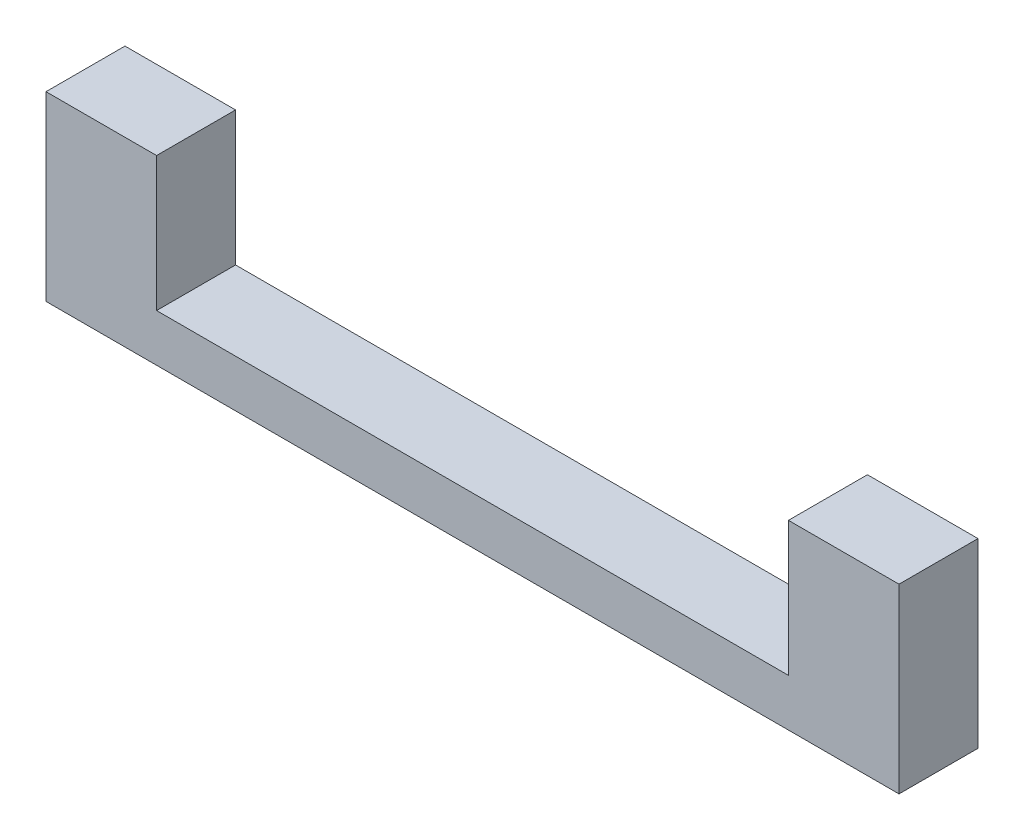
ISO-10303-21;
HEADER;
FILE_DESCRIPTION(('STEP AP214'),'2;1');
FILE_NAME('part.step','',(''),(''),'','','');
FILE_SCHEMA(('AUTOMOTIVE_DESIGN { 1 0 10303 214 1 1 1 1 }'));
ENDSEC;
DATA;
#1=APPLICATION_CONTEXT('core data for automotive mechanical design processes');
#2=APPLICATION_PROTOCOL_DEFINITION('international standard','automotive_design',2000,#1);
#3=PRODUCT_CONTEXT('',#1,'mechanical');
#4=PRODUCT('Part','Part','',(#3));
#5=PRODUCT_RELATED_PRODUCT_CATEGORY('part','',(#4));
#6=PRODUCT_DEFINITION_FORMATION('','',#4);
#7=PRODUCT_DEFINITION_CONTEXT('part definition',#1,'design');
#8=PRODUCT_DEFINITION('design','',#6,#7);
#9=PRODUCT_DEFINITION_SHAPE('','',#8);
#10=(LENGTH_UNIT() NAMED_UNIT(*) SI_UNIT(.MILLI.,.METRE.));
#11=(NAMED_UNIT(*) PLANE_ANGLE_UNIT() SI_UNIT($,.RADIAN.));
#12=(NAMED_UNIT(*) SI_UNIT($,.STERADIAN.) SOLID_ANGLE_UNIT());
#13=UNCERTAINTY_MEASURE_WITH_UNIT(LENGTH_MEASURE(1.E-05),#10,'distance_accuracy_value','');
#14=(GEOMETRIC_REPRESENTATION_CONTEXT(3) GLOBAL_UNCERTAINTY_ASSIGNED_CONTEXT((#13)) GLOBAL_UNIT_ASSIGNED_CONTEXT((#10,
#11,#12)) REPRESENTATION_CONTEXT('',''));
#15=CARTESIAN_POINT('',(0.,0.,0.));
#16=DIRECTION('',(0.,0.,1.));
#17=DIRECTION('',(1.,0.,0.));
#18=AXIS2_PLACEMENT_3D('',#15,#16,#17);
#19=CARTESIAN_POINT('',(5.,4.25,4.25));
#20=DIRECTION('',(0.,-1.,0.));
#21=DIRECTION('',(0.,0.,-1.));
#22=AXIS2_PLACEMENT_3D('',#19,#20,#21);
#23=PLANE('',#22);
#24=DIRECTION('',(0.,0.,1.));
#25=VECTOR('',#24,1.);
#26=CARTESIAN_POINT('',(5.,4.25,4.25));
#27=LINE('',#26,#25);
#28=CARTESIAN_POINT('',(5.,4.25,-0.750000000000002));
#29=VERTEX_POINT('',#28);
#30=CARTESIAN_POINT('',(5.,4.25,4.25));
#31=VERTEX_POINT('',#30);
#32=EDGE_CURVE('E112',#29,#31,#27,.T.);
#33=ORIENTED_EDGE('',*,*,#32,.F.);
#34=DIRECTION('',(1.,0.,0.));
#35=VECTOR('',#34,1.);
#36=CARTESIAN_POINT('',(-2.,4.25,-0.750000000000002));
#37=LINE('',#36,#35);
#38=CARTESIAN_POINT('',(-2.,4.25,-0.750000000000002));
#39=VERTEX_POINT('',#38);
#40=EDGE_CURVE('E52',#39,#29,#37,.T.);
#41=ORIENTED_EDGE('',*,*,#40,.F.);
#42=DIRECTION('',(0.,0.,-1.));
#43=VECTOR('',#42,1.);
#44=CARTESIAN_POINT('',(-2.,4.25,-4.25));
#45=LINE('',#44,#43);
#46=CARTESIAN_POINT('',(-2.,4.25,4.25));
#47=VERTEX_POINT('',#46);
#48=EDGE_CURVE('E45',#47,#39,#45,.T.);
#49=ORIENTED_EDGE('',*,*,#48,.F.);
#50=DIRECTION('',(-1.,0.,0.));
#51=VECTOR('',#50,1.);
#52=CARTESIAN_POINT('',(5.,4.25,4.25));
#53=LINE('',#52,#51);
#54=EDGE_CURVE('E11',#31,#47,#53,.T.);
#55=ORIENTED_EDGE('',*,*,#54,.F.);
#56=EDGE_LOOP('',(#33,#41,#49,#55));
#57=FACE_BOUND('',#56,.T.);
#58=ADVANCED_FACE('F38',(#57),#23,.F.);
#59=CARTESIAN_POINT('',(0.,-4.25,0.));
#60=DIRECTION('',(0.,-1.,0.));
#61=DIRECTION('',(0.,0.,-1.));
#62=AXIS2_PLACEMENT_3D('',#59,#60,#61);
#63=PLANE('',#62);
#64=DIRECTION('',(0.,0.,1.));
#65=VECTOR('',#64,1.);
#66=CARTESIAN_POINT('',(45.,-4.25,-4.25));
#67=LINE('',#66,#65);
#68=CARTESIAN_POINT('',(45.,-4.25,-0.750000000000002));
#69=VERTEX_POINT('',#68);
#70=CARTESIAN_POINT('',(45.,-4.25,4.25));
#71=VERTEX_POINT('',#70);
#72=EDGE_CURVE('E138',#69,#71,#67,.T.);
#73=ORIENTED_EDGE('',*,*,#72,.F.);
#74=DIRECTION('',(-1.,0.,0.));
#75=VECTOR('',#74,1.);
#76=CARTESIAN_POINT('',(0.,-4.25,-0.750000000000002));
#77=LINE('',#76,#75);
#78=CARTESIAN_POINT('',(5.,-4.25,-0.750000000000002));
#79=VERTEX_POINT('',#78);
#80=EDGE_CURVE('E155',#69,#79,#77,.T.);
#81=ORIENTED_EDGE('',*,*,#80,.T.);
#82=DIRECTION('',(0.,0.,-1.));
#83=VECTOR('',#82,1.);
#84=CARTESIAN_POINT('',(5.,-4.25,4.25));
#85=LINE('',#84,#83);
#86=CARTESIAN_POINT('',(5.,-4.25,4.25));
#87=VERTEX_POINT('',#86);
#88=EDGE_CURVE('E145',#87,#79,#85,.T.);
#89=ORIENTED_EDGE('',*,*,#88,.F.);
#90=DIRECTION('',(-1.,0.,0.));
#91=VECTOR('',#90,1.);
#92=CARTESIAN_POINT('',(-2.,-4.25,4.25));
#93=LINE('',#92,#91);
#94=EDGE_CURVE('E122',#71,#87,#93,.T.);
#95=ORIENTED_EDGE('',*,*,#94,.F.);
#96=EDGE_LOOP('',(#73,#81,#89,#95));
#97=FACE_BOUND('',#96,.T.);
#98=ADVANCED_FACE('F188',(#97),#63,.F.);
#99=CARTESIAN_POINT('',(5.,-4.25,4.25));
#100=DIRECTION('',(0.,0.,-1.));
#101=DIRECTION('',(-1.,0.,0.));
#102=AXIS2_PLACEMENT_3D('',#99,#100,#101);
#103=PLANE('',#102);
#104=DIRECTION('',(0.,1.,0.));
#105=VECTOR('',#104,1.);
#106=CARTESIAN_POINT('',(52.,-7.25,4.25));
#107=LINE('',#106,#105);
#108=CARTESIAN_POINT('',(52.,-7.25,4.25));
#109=VERTEX_POINT('',#108);
#110=CARTESIAN_POINT('',(52.,4.25,4.25));
#111=VERTEX_POINT('',#110);
#112=EDGE_CURVE('E117',#109,#111,#107,.T.);
#113=ORIENTED_EDGE('',*,*,#112,.T.);
#114=DIRECTION('',(-1.,0.,0.));
#115=VECTOR('',#114,1.);
#116=CARTESIAN_POINT('',(52.,4.25,4.25));
#117=LINE('',#116,#115);
#118=CARTESIAN_POINT('',(45.,4.25,4.25));
#119=VERTEX_POINT('',#118);
#120=EDGE_CURVE('E131',#111,#119,#117,.T.);
#121=ORIENTED_EDGE('',*,*,#120,.T.);
#122=DIRECTION('',(0.,-1.,0.));
#123=VECTOR('',#122,1.);
#124=CARTESIAN_POINT('',(45.,15.2613577727726,4.25));
#125=LINE('',#124,#123);
#126=EDGE_CURVE('E135',#119,#71,#125,.T.);
#127=ORIENTED_EDGE('',*,*,#126,.T.);
#128=ORIENTED_EDGE('',*,*,#94,.T.);
#129=DIRECTION('',(0.,-1.,0.));
#130=VECTOR('',#129,1.);
#131=CARTESIAN_POINT('',(5.,4.25,4.25));
#132=LINE('',#131,#130);
#133=EDGE_CURVE('E148',#31,#87,#132,.T.);
#134=ORIENTED_EDGE('',*,*,#133,.F.);
#135=ORIENTED_EDGE('',*,*,#54,.T.);
#136=DIRECTION('',(0.,1.,0.));
#137=VECTOR('',#136,1.);
#138=CARTESIAN_POINT('',(-2.,-4.25,4.25));
#139=LINE('',#138,#137);
#140=CARTESIAN_POINT('',(-2.,-7.25,4.25));
#141=VERTEX_POINT('',#140);
#142=EDGE_CURVE('E116',#141,#47,#139,.T.);
#143=ORIENTED_EDGE('',*,*,#142,.F.);
#144=DIRECTION('',(-1.,0.,0.));
#145=VECTOR('',#144,1.);
#146=CARTESIAN_POINT('',(-2.,-7.25,4.25));
#147=LINE('',#146,#145);
#148=EDGE_CURVE('E121',#109,#141,#147,.T.);
#149=ORIENTED_EDGE('',*,*,#148,.F.);
#150=EDGE_LOOP('',(#113,#121,#127,#128,#134,#135,#143,#149));
#151=FACE_BOUND('',#150,.T.);
#152=ADVANCED_FACE('F171',(#151),#103,.F.);
#153=CARTESIAN_POINT('',(-2.,0.,0.));
#154=DIRECTION('',(1.,0.,0.));
#155=DIRECTION('',(0.,0.,-1.));
#156=AXIS2_PLACEMENT_3D('',#153,#154,#155);
#157=PLANE('',#156);
#158=ORIENTED_EDGE('',*,*,#48,.T.);
#159=DIRECTION('',(0.,1.,0.));
#160=VECTOR('',#159,1.);
#161=CARTESIAN_POINT('',(-2.,-10.75,-0.750000000000002));
#162=LINE('',#161,#160);
#163=CARTESIAN_POINT('',(-2.,-7.25,-0.750000000000002));
#164=VERTEX_POINT('',#163);
#165=EDGE_CURVE('E99',#164,#39,#162,.T.);
#166=ORIENTED_EDGE('',*,*,#165,.F.);
#167=DIRECTION('',(0.,0.,-1.));
#168=VECTOR('',#167,1.);
#169=CARTESIAN_POINT('',(-2.,-7.25,4.25));
#170=LINE('',#169,#168);
#171=EDGE_CURVE('E124',#141,#164,#170,.T.);
#172=ORIENTED_EDGE('',*,*,#171,.F.);
#173=ORIENTED_EDGE('',*,*,#142,.T.);
#174=EDGE_LOOP('',(#158,#166,#172,#173));
#175=FACE_BOUND('',#174,.T.);
#176=ADVANCED_FACE('F115',(#175),#157,.F.);
#177=CARTESIAN_POINT('',(52.,-7.25,4.25));
#178=DIRECTION('',(-1.,0.,0.));
#179=DIRECTION('',(0.,0.,1.));
#180=AXIS2_PLACEMENT_3D('',#177,#178,#179);
#181=PLANE('',#180);
#182=DIRECTION('',(0.,1.,0.));
#183=VECTOR('',#182,1.);
#184=CARTESIAN_POINT('',(52.,-10.75,-0.750000000000002));
#185=LINE('',#184,#183);
#186=CARTESIAN_POINT('',(52.,-7.25,-0.750000000000002));
#187=VERTEX_POINT('',#186);
#188=CARTESIAN_POINT('',(52.,4.25,-0.750000000000002));
#189=VERTEX_POINT('',#188);
#190=EDGE_CURVE('E107',#187,#189,#185,.T.);
#191=ORIENTED_EDGE('',*,*,#190,.T.);
#192=DIRECTION('',(0.,0.,1.));
#193=VECTOR('',#192,1.);
#194=CARTESIAN_POINT('',(52.,4.25,-4.25));
#195=LINE('',#194,#193);
#196=EDGE_CURVE('E125',#189,#111,#195,.T.);
#197=ORIENTED_EDGE('',*,*,#196,.T.);
#198=ORIENTED_EDGE('',*,*,#112,.F.);
#199=DIRECTION('',(0.,0.,1.));
#200=VECTOR('',#199,1.);
#201=CARTESIAN_POINT('',(52.,-7.25,4.25));
#202=LINE('',#201,#200);
#203=EDGE_CURVE('E128',#187,#109,#202,.T.);
#204=ORIENTED_EDGE('',*,*,#203,.F.);
#205=EDGE_LOOP('',(#191,#197,#198,#204));
#206=FACE_BOUND('',#205,.T.);
#207=ADVANCED_FACE('F163',(#206),#181,.F.);
#208=CARTESIAN_POINT('',(0.,-7.25,0.));
#209=DIRECTION('',(0.,-1.,0.));
#210=DIRECTION('',(0.,0.,-1.));
#211=AXIS2_PLACEMENT_3D('',#208,#209,#210);
#212=PLANE('',#211);
#213=DIRECTION('',(-1.,0.,0.));
#214=VECTOR('',#213,1.);
#215=CARTESIAN_POINT('',(0.,-7.25,-0.750000000000002));
#216=LINE('',#215,#214);
#217=EDGE_CURVE('E102',#187,#164,#216,.T.);
#218=ORIENTED_EDGE('',*,*,#217,.F.);
#219=ORIENTED_EDGE('',*,*,#203,.T.);
#220=ORIENTED_EDGE('',*,*,#148,.T.);
#221=ORIENTED_EDGE('',*,*,#171,.T.);
#222=EDGE_LOOP('',(#218,#219,#220,#221));
#223=FACE_BOUND('',#222,.T.);
#224=ADVANCED_FACE('F175',(#223),#212,.T.);
#225=CARTESIAN_POINT('',(45.,15.2613577727726,-4.25));
#226=DIRECTION('',(1.,0.,0.));
#227=DIRECTION('',(0.,0.,-1.));
#228=AXIS2_PLACEMENT_3D('',#225,#226,#227);
#229=PLANE('',#228);
#230=DIRECTION('',(0.,0.,-1.));
#231=VECTOR('',#230,1.);
#232=CARTESIAN_POINT('',(45.,4.25,-4.25));
#233=LINE('',#232,#231);
#234=CARTESIAN_POINT('',(45.,4.25,-0.750000000000002));
#235=VERTEX_POINT('',#234);
#236=EDGE_CURVE('E134',#119,#235,#233,.T.);
#237=ORIENTED_EDGE('',*,*,#236,.T.);
#238=DIRECTION('',(0.,-1.,0.));
#239=VECTOR('',#238,1.);
#240=CARTESIAN_POINT('',(45.,15.2613577727726,-0.750000000000002));
#241=LINE('',#240,#239);
#242=EDGE_CURVE('E152',#235,#69,#241,.T.);
#243=ORIENTED_EDGE('',*,*,#242,.T.);
#244=ORIENTED_EDGE('',*,*,#72,.T.);
#245=ORIENTED_EDGE('',*,*,#126,.F.);
#246=EDGE_LOOP('',(#237,#243,#244,#245));
#247=FACE_BOUND('',#246,.T.);
#248=ADVANCED_FACE('F177',(#247),#229,.F.);
#249=CARTESIAN_POINT('',(5.,4.25,4.25));
#250=DIRECTION('',(0.,-1.,0.));
#251=DIRECTION('',(0.,0.,-1.));
#252=AXIS2_PLACEMENT_3D('',#249,#250,#251);
#253=PLANE('',#252);
#254=ORIENTED_EDGE('',*,*,#196,.F.);
#255=EDGE_CURVE('E113',#235,#189,#37,.T.);
#256=ORIENTED_EDGE('',*,*,#255,.F.);
#257=ORIENTED_EDGE('',*,*,#236,.F.);
#258=ORIENTED_EDGE('',*,*,#120,.F.);
#259=EDGE_LOOP('',(#254,#256,#257,#258));
#260=FACE_BOUND('',#259,.T.);
#261=ADVANCED_FACE('F169',(#260),#253,.F.);
#262=CARTESIAN_POINT('',(5.,0.,0.));
#263=DIRECTION('',(1.,0.,0.));
#264=DIRECTION('',(0.,0.,-1.));
#265=AXIS2_PLACEMENT_3D('',#262,#263,#264);
#266=PLANE('',#265);
#267=DIRECTION('',(0.,-1.,0.));
#268=VECTOR('',#267,1.);
#269=CARTESIAN_POINT('',(5.,0.,-0.750000000000002));
#270=LINE('',#269,#268);
#271=EDGE_CURVE('E158',#29,#79,#270,.T.);
#272=ORIENTED_EDGE('',*,*,#271,.F.);
#273=ORIENTED_EDGE('',*,*,#32,.T.);
#274=ORIENTED_EDGE('',*,*,#133,.T.);
#275=ORIENTED_EDGE('',*,*,#88,.T.);
#276=EDGE_LOOP('',(#272,#273,#274,#275));
#277=FACE_BOUND('',#276,.T.);
#278=ADVANCED_FACE('F221',(#277),#266,.T.);
#279=CARTESIAN_POINT('',(-2.,-10.75,-0.750000000000002));
#280=DIRECTION('',(0.,0.,1.));
#281=DIRECTION('',(1.,0.,0.));
#282=AXIS2_PLACEMENT_3D('',#279,#280,#281);
#283=PLANE('',#282);
#284=ORIENTED_EDGE('',*,*,#80,.F.);
#285=ORIENTED_EDGE('',*,*,#242,.F.);
#286=ORIENTED_EDGE('',*,*,#255,.T.);
#287=ORIENTED_EDGE('',*,*,#190,.F.);
#288=ORIENTED_EDGE('',*,*,#217,.T.);
#289=ORIENTED_EDGE('',*,*,#165,.T.);
#290=ORIENTED_EDGE('',*,*,#40,.T.);
#291=ORIENTED_EDGE('',*,*,#271,.T.);
#292=EDGE_LOOP('',(#284,#285,#286,#287,#288,#289,#290,#291));
#293=FACE_BOUND('',#292,.T.);
#294=ADVANCED_FACE('F100',(#293),#283,.F.);
#295=CLOSED_SHELL('',(#58,#98,#152,#176,#207,#224,#248,#261,#278,#294));
#296=MANIFOLD_SOLID_BREP('B2',#295);
#297=ADVANCED_BREP_SHAPE_REPRESENTATION('',(#18,#296),#14);
#298=SHAPE_DEFINITION_REPRESENTATION(#9,#297);
ENDSEC;
END-ISO-10303-21;
